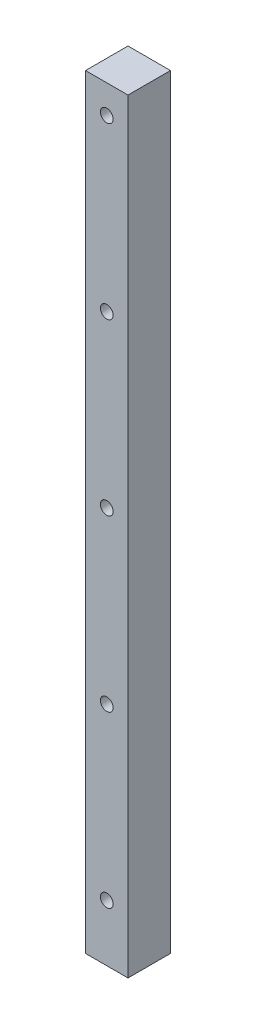
ISO-10303-21;
HEADER;
FILE_DESCRIPTION(('STEP AP214'),'2;1');
FILE_NAME('part.step','',(''),(''),'','','');
FILE_SCHEMA(('AUTOMOTIVE_DESIGN { 1 0 10303 214 1 1 1 1 }'));
ENDSEC;
DATA;
#1=APPLICATION_CONTEXT('core data for automotive mechanical design processes');
#2=APPLICATION_PROTOCOL_DEFINITION('international standard','automotive_design',2000,#1);
#3=PRODUCT_CONTEXT('',#1,'mechanical');
#4=PRODUCT('Part','Part','',(#3));
#5=PRODUCT_RELATED_PRODUCT_CATEGORY('part','',(#4));
#6=PRODUCT_DEFINITION_FORMATION('','',#4);
#7=PRODUCT_DEFINITION_CONTEXT('part definition',#1,'design');
#8=PRODUCT_DEFINITION('design','',#6,#7);
#9=PRODUCT_DEFINITION_SHAPE('','',#8);
#10=(LENGTH_UNIT() NAMED_UNIT(*) SI_UNIT(.MILLI.,.METRE.));
#11=(NAMED_UNIT(*) PLANE_ANGLE_UNIT() SI_UNIT($,.RADIAN.));
#12=(NAMED_UNIT(*) SI_UNIT($,.STERADIAN.) SOLID_ANGLE_UNIT());
#13=UNCERTAINTY_MEASURE_WITH_UNIT(LENGTH_MEASURE(1.E-05),#10,'distance_accuracy_value','');
#14=(GEOMETRIC_REPRESENTATION_CONTEXT(3) GLOBAL_UNCERTAINTY_ASSIGNED_CONTEXT((#13)) GLOBAL_UNIT_ASSIGNED_CONTEXT((#10,
#11,#12)) REPRESENTATION_CONTEXT('',''));
#15=CARTESIAN_POINT('',(0.,0.,0.));
#16=DIRECTION('',(0.,0.,1.));
#17=DIRECTION('',(1.,0.,0.));
#18=AXIS2_PLACEMENT_3D('',#15,#16,#17);
#19=CARTESIAN_POINT('',(-7.5,270.,7.5));
#20=DIRECTION('',(1.,0.,0.));
#21=DIRECTION('',(0.,0.,-1.));
#22=AXIS2_PLACEMENT_3D('',#19,#20,#21);
#23=PLANE('',#22);
#24=DIRECTION('',(0.,0.,1.));
#25=VECTOR('',#24,1.);
#26=CARTESIAN_POINT('',(-7.5,0.,7.5));
#27=LINE('',#26,#25);
#28=CARTESIAN_POINT('',(-7.5,0.,-7.5));
#29=VERTEX_POINT('',#28);
#30=CARTESIAN_POINT('',(-7.5,0.,7.5));
#31=VERTEX_POINT('',#30);
#32=EDGE_CURVE('E104',#29,#31,#27,.T.);
#33=ORIENTED_EDGE('',*,*,#32,.T.);
#34=DIRECTION('',(0.,-1.,0.));
#35=VECTOR('',#34,1.);
#36=CARTESIAN_POINT('',(-7.5,270.,7.5));
#37=LINE('',#36,#35);
#38=CARTESIAN_POINT('',(-7.5,270.,7.5));
#39=VERTEX_POINT('',#38);
#40=EDGE_CURVE('E11',#39,#31,#37,.T.);
#41=ORIENTED_EDGE('',*,*,#40,.F.);
#42=DIRECTION('',(0.,0.,1.));
#43=VECTOR('',#42,1.);
#44=CARTESIAN_POINT('',(-7.5,270.,7.5));
#45=LINE('',#44,#43);
#46=CARTESIAN_POINT('',(-7.5,270.,-7.5));
#47=VERTEX_POINT('',#46);
#48=EDGE_CURVE('E92',#47,#39,#45,.T.);
#49=ORIENTED_EDGE('',*,*,#48,.F.);
#50=DIRECTION('',(0.,-1.,0.));
#51=VECTOR('',#50,1.);
#52=CARTESIAN_POINT('',(-7.5,270.,-7.5));
#53=LINE('',#52,#51);
#54=EDGE_CURVE('E100',#47,#29,#53,.T.);
#55=ORIENTED_EDGE('',*,*,#54,.T.);
#56=EDGE_LOOP('',(#33,#41,#49,#55));
#57=FACE_BOUND('',#56,.T.);
#58=ADVANCED_FACE('F41',(#57),#23,.F.);
#59=CARTESIAN_POINT('',(7.5,270.,7.5));
#60=DIRECTION('',(0.,0.,-1.));
#61=DIRECTION('',(-1.,0.,0.));
#62=AXIS2_PLACEMENT_3D('',#59,#60,#61);
#63=PLANE('',#62);
#64=CARTESIAN_POINT('',(0.,20.,7.49999999999999));
#65=DIRECTION('',(0.,0.,-1.));
#66=DIRECTION('',(-1.,0.,0.));
#67=AXIS2_PLACEMENT_3D('',#64,#65,#66);
#68=CIRCLE('',#67,2.25);
#69=CARTESIAN_POINT('',(-2.25,20.,7.49999999999999));
#70=VERTEX_POINT('',#69);
#71=EDGE_CURVE('E107',#70,#70,#68,.T.);
#72=ORIENTED_EDGE('',*,*,#71,.T.);
#73=EDGE_LOOP('',(#72));
#74=FACE_BOUND('',#73,.T.);
#75=CARTESIAN_POINT('',(0.,80.,7.49999999999999));
#76=DIRECTION('',(0.,0.,-1.));
#77=DIRECTION('',(-1.,0.,0.));
#78=AXIS2_PLACEMENT_3D('',#75,#76,#77);
#79=CIRCLE('',#78,2.25);
#80=CARTESIAN_POINT('',(-2.25,80.,7.49999999999999));
#81=VERTEX_POINT('',#80);
#82=EDGE_CURVE('E120',#81,#81,#79,.T.);
#83=ORIENTED_EDGE('',*,*,#82,.T.);
#84=EDGE_LOOP('',(#83));
#85=FACE_BOUND('',#84,.T.);
#86=CARTESIAN_POINT('',(0.,140.,7.49999999999999));
#87=DIRECTION('',(0.,0.,-1.));
#88=DIRECTION('',(-1.,0.,0.));
#89=AXIS2_PLACEMENT_3D('',#86,#87,#88);
#90=CIRCLE('',#89,2.25);
#91=CARTESIAN_POINT('',(-2.25,140.,7.49999999999999));
#92=VERTEX_POINT('',#91);
#93=EDGE_CURVE('E123',#92,#92,#90,.T.);
#94=ORIENTED_EDGE('',*,*,#93,.T.);
#95=EDGE_LOOP('',(#94));
#96=FACE_BOUND('',#95,.T.);
#97=CARTESIAN_POINT('',(0.,200.,7.49999999999999));
#98=DIRECTION('',(0.,0.,-1.));
#99=DIRECTION('',(-1.,0.,0.));
#100=AXIS2_PLACEMENT_3D('',#97,#98,#99);
#101=CIRCLE('',#100,2.25);
#102=CARTESIAN_POINT('',(-2.25,200.,7.49999999999999));
#103=VERTEX_POINT('',#102);
#104=EDGE_CURVE('E126',#103,#103,#101,.T.);
#105=ORIENTED_EDGE('',*,*,#104,.T.);
#106=EDGE_LOOP('',(#105));
#107=FACE_BOUND('',#106,.T.);
#108=CARTESIAN_POINT('',(0.,260.,7.49999999999999));
#109=DIRECTION('',(0.,0.,-1.));
#110=DIRECTION('',(-1.,0.,0.));
#111=AXIS2_PLACEMENT_3D('',#108,#109,#110);
#112=CIRCLE('',#111,2.25);
#113=CARTESIAN_POINT('',(-2.25,260.,7.49999999999999));
#114=VERTEX_POINT('',#113);
#115=EDGE_CURVE('E129',#114,#114,#112,.T.);
#116=ORIENTED_EDGE('',*,*,#115,.T.);
#117=EDGE_LOOP('',(#116));
#118=FACE_BOUND('',#117,.T.);
#119=DIRECTION('',(1.,0.,0.));
#120=VECTOR('',#119,1.);
#121=CARTESIAN_POINT('',(7.5,0.,7.5));
#122=LINE('',#121,#120);
#123=CARTESIAN_POINT('',(7.5,0.,7.5));
#124=VERTEX_POINT('',#123);
#125=EDGE_CURVE('E96',#31,#124,#122,.T.);
#126=ORIENTED_EDGE('',*,*,#125,.T.);
#127=DIRECTION('',(0.,-1.,0.));
#128=VECTOR('',#127,1.);
#129=CARTESIAN_POINT('',(7.5,270.,7.5));
#130=LINE('',#129,#128);
#131=CARTESIAN_POINT('',(7.5,270.,7.5));
#132=VERTEX_POINT('',#131);
#133=EDGE_CURVE('E49',#132,#124,#130,.T.);
#134=ORIENTED_EDGE('',*,*,#133,.F.);
#135=DIRECTION('',(1.,0.,0.));
#136=VECTOR('',#135,1.);
#137=CARTESIAN_POINT('',(7.5,270.,7.5));
#138=LINE('',#137,#136);
#139=EDGE_CURVE('E87',#39,#132,#138,.T.);
#140=ORIENTED_EDGE('',*,*,#139,.F.);
#141=ORIENTED_EDGE('',*,*,#40,.T.);
#142=EDGE_LOOP('',(#126,#134,#140,#141));
#143=FACE_BOUND('',#142,.T.);
#144=ADVANCED_FACE('F95',(#74,#85,#96,#107,#118,#143),#63,.F.);
#145=CARTESIAN_POINT('',(7.5,270.,7.5));
#146=DIRECTION('',(-1.,0.,0.));
#147=DIRECTION('',(0.,0.,1.));
#148=AXIS2_PLACEMENT_3D('',#145,#146,#147);
#149=PLANE('',#148);
#150=DIRECTION('',(0.,0.,-1.));
#151=VECTOR('',#150,1.);
#152=CARTESIAN_POINT('',(7.5,0.,7.5));
#153=LINE('',#152,#151);
#154=CARTESIAN_POINT('',(7.5,0.,-7.5));
#155=VERTEX_POINT('',#154);
#156=EDGE_CURVE('E74',#124,#155,#153,.T.);
#157=ORIENTED_EDGE('',*,*,#156,.T.);
#158=DIRECTION('',(0.,-1.,0.));
#159=VECTOR('',#158,1.);
#160=CARTESIAN_POINT('',(7.5,270.,-7.5));
#161=LINE('',#160,#159);
#162=CARTESIAN_POINT('',(7.5,270.,-7.5));
#163=VERTEX_POINT('',#162);
#164=EDGE_CURVE('E97',#163,#155,#161,.T.);
#165=ORIENTED_EDGE('',*,*,#164,.F.);
#166=DIRECTION('',(0.,0.,-1.));
#167=VECTOR('',#166,1.);
#168=CARTESIAN_POINT('',(7.5,270.,7.5));
#169=LINE('',#168,#167);
#170=EDGE_CURVE('E90',#132,#163,#169,.T.);
#171=ORIENTED_EDGE('',*,*,#170,.F.);
#172=ORIENTED_EDGE('',*,*,#133,.T.);
#173=EDGE_LOOP('',(#157,#165,#171,#172));
#174=FACE_BOUND('',#173,.T.);
#175=ADVANCED_FACE('F98',(#174),#149,.F.);
#176=CARTESIAN_POINT('',(7.5,270.,-7.5));
#177=DIRECTION('',(0.,0.,1.));
#178=DIRECTION('',(1.,0.,0.));
#179=AXIS2_PLACEMENT_3D('',#176,#177,#178);
#180=PLANE('',#179);
#181=CARTESIAN_POINT('',(0.,20.,-7.5));
#182=DIRECTION('',(0.,0.,-1.));
#183=DIRECTION('',(-1.,0.,0.));
#184=AXIS2_PLACEMENT_3D('',#181,#182,#183);
#185=CIRCLE('',#184,2.25);
#186=CARTESIAN_POINT('',(-2.25,20.,-7.5));
#187=VERTEX_POINT('',#186);
#188=EDGE_CURVE('E132',#187,#187,#185,.T.);
#189=ORIENTED_EDGE('',*,*,#188,.F.);
#190=EDGE_LOOP('',(#189));
#191=FACE_BOUND('',#190,.T.);
#192=CARTESIAN_POINT('',(0.,80.,-7.5));
#193=DIRECTION('',(0.,0.,-1.));
#194=DIRECTION('',(-1.,0.,0.));
#195=AXIS2_PLACEMENT_3D('',#192,#193,#194);
#196=CIRCLE('',#195,2.25);
#197=CARTESIAN_POINT('',(-2.25,80.,-7.5));
#198=VERTEX_POINT('',#197);
#199=EDGE_CURVE('E142',#198,#198,#196,.T.);
#200=ORIENTED_EDGE('',*,*,#199,.F.);
#201=EDGE_LOOP('',(#200));
#202=FACE_BOUND('',#201,.T.);
#203=CARTESIAN_POINT('',(0.,140.,-7.5));
#204=DIRECTION('',(0.,0.,-1.));
#205=DIRECTION('',(-1.,0.,0.));
#206=AXIS2_PLACEMENT_3D('',#203,#204,#205);
#207=CIRCLE('',#206,2.25);
#208=CARTESIAN_POINT('',(-2.25,140.,-7.5));
#209=VERTEX_POINT('',#208);
#210=EDGE_CURVE('E139',#209,#209,#207,.T.);
#211=ORIENTED_EDGE('',*,*,#210,.F.);
#212=EDGE_LOOP('',(#211));
#213=FACE_BOUND('',#212,.T.);
#214=CARTESIAN_POINT('',(0.,200.,-7.5));
#215=DIRECTION('',(0.,0.,-1.));
#216=DIRECTION('',(-1.,0.,0.));
#217=AXIS2_PLACEMENT_3D('',#214,#215,#216);
#218=CIRCLE('',#217,2.25);
#219=CARTESIAN_POINT('',(-2.25,200.,-7.5));
#220=VERTEX_POINT('',#219);
#221=EDGE_CURVE('E136',#220,#220,#218,.T.);
#222=ORIENTED_EDGE('',*,*,#221,.F.);
#223=EDGE_LOOP('',(#222));
#224=FACE_BOUND('',#223,.T.);
#225=CARTESIAN_POINT('',(0.,260.,-7.5));
#226=DIRECTION('',(0.,0.,-1.));
#227=DIRECTION('',(-1.,0.,0.));
#228=AXIS2_PLACEMENT_3D('',#225,#226,#227);
#229=CIRCLE('',#228,2.25);
#230=CARTESIAN_POINT('',(-2.25,260.,-7.5));
#231=VERTEX_POINT('',#230);
#232=EDGE_CURVE('E133',#231,#231,#229,.T.);
#233=ORIENTED_EDGE('',*,*,#232,.F.);
#234=EDGE_LOOP('',(#233));
#235=FACE_BOUND('',#234,.T.);
#236=DIRECTION('',(-1.,0.,0.));
#237=VECTOR('',#236,1.);
#238=CARTESIAN_POINT('',(7.5,0.,-7.5));
#239=LINE('',#238,#237);
#240=EDGE_CURVE('E80',#155,#29,#239,.T.);
#241=ORIENTED_EDGE('',*,*,#240,.T.);
#242=ORIENTED_EDGE('',*,*,#54,.F.);
#243=DIRECTION('',(-1.,0.,0.));
#244=VECTOR('',#243,1.);
#245=CARTESIAN_POINT('',(7.5,270.,-7.5));
#246=LINE('',#245,#244);
#247=EDGE_CURVE('E57',#163,#47,#246,.T.);
#248=ORIENTED_EDGE('',*,*,#247,.F.);
#249=ORIENTED_EDGE('',*,*,#164,.T.);
#250=EDGE_LOOP('',(#241,#242,#248,#249));
#251=FACE_BOUND('',#250,.T.);
#252=ADVANCED_FACE('F112',(#191,#202,#213,#224,#235,#251),#180,.F.);
#253=CARTESIAN_POINT('',(0.,270.,0.));
#254=DIRECTION('',(0.,1.,0.));
#255=DIRECTION('',(0.,0.,1.));
#256=AXIS2_PLACEMENT_3D('',#253,#254,#255);
#257=PLANE('',#256);
#258=ORIENTED_EDGE('',*,*,#48,.T.);
#259=ORIENTED_EDGE('',*,*,#139,.T.);
#260=ORIENTED_EDGE('',*,*,#170,.T.);
#261=ORIENTED_EDGE('',*,*,#247,.T.);
#262=EDGE_LOOP('',(#258,#259,#260,#261));
#263=FACE_BOUND('',#262,.T.);
#264=ADVANCED_FACE('F88',(#263),#257,.T.);
#265=CARTESIAN_POINT('',(0.,0.,0.));
#266=DIRECTION('',(0.,1.,0.));
#267=DIRECTION('',(0.,0.,1.));
#268=AXIS2_PLACEMENT_3D('',#265,#266,#267);
#269=PLANE('',#268);
#270=ORIENTED_EDGE('',*,*,#32,.F.);
#271=ORIENTED_EDGE('',*,*,#240,.F.);
#272=ORIENTED_EDGE('',*,*,#156,.F.);
#273=ORIENTED_EDGE('',*,*,#125,.F.);
#274=EDGE_LOOP('',(#270,#271,#272,#273));
#275=FACE_BOUND('',#274,.T.);
#276=ADVANCED_FACE('F115',(#275),#269,.F.);
#277=CARTESIAN_POINT('',(0.,260.,111.5));
#278=DIRECTION('',(0.,0.,-1.));
#279=DIRECTION('',(-1.,0.,0.));
#280=AXIS2_PLACEMENT_3D('',#277,#278,#279);
#281=CYLINDRICAL_SURFACE('',#280,2.25);
#282=ORIENTED_EDGE('',*,*,#232,.T.);
#283=EDGE_LOOP('',(#282));
#284=FACE_BOUND('',#283,.T.);
#285=ORIENTED_EDGE('',*,*,#115,.F.);
#286=EDGE_LOOP('',(#285));
#287=FACE_BOUND('',#286,.T.);
#288=ADVANCED_FACE('F162',(#284,#287),#281,.F.);
#289=CARTESIAN_POINT('',(0.,200.,111.5));
#290=DIRECTION('',(0.,0.,-1.));
#291=DIRECTION('',(-1.,0.,0.));
#292=AXIS2_PLACEMENT_3D('',#289,#290,#291);
#293=CYLINDRICAL_SURFACE('',#292,2.25);
#294=ORIENTED_EDGE('',*,*,#221,.T.);
#295=EDGE_LOOP('',(#294));
#296=FACE_BOUND('',#295,.T.);
#297=ORIENTED_EDGE('',*,*,#104,.F.);
#298=EDGE_LOOP('',(#297));
#299=FACE_BOUND('',#298,.T.);
#300=ADVANCED_FACE('F165',(#296,#299),#293,.F.);
#301=CARTESIAN_POINT('',(0.,140.,111.5));
#302=DIRECTION('',(0.,0.,-1.));
#303=DIRECTION('',(-1.,0.,0.));
#304=AXIS2_PLACEMENT_3D('',#301,#302,#303);
#305=CYLINDRICAL_SURFACE('',#304,2.25);
#306=ORIENTED_EDGE('',*,*,#210,.T.);
#307=EDGE_LOOP('',(#306));
#308=FACE_BOUND('',#307,.T.);
#309=ORIENTED_EDGE('',*,*,#93,.F.);
#310=EDGE_LOOP('',(#309));
#311=FACE_BOUND('',#310,.T.);
#312=ADVANCED_FACE('F184',(#308,#311),#305,.F.);
#313=CARTESIAN_POINT('',(0.,80.,111.5));
#314=DIRECTION('',(0.,0.,-1.));
#315=DIRECTION('',(-1.,0.,0.));
#316=AXIS2_PLACEMENT_3D('',#313,#314,#315);
#317=CYLINDRICAL_SURFACE('',#316,2.25);
#318=ORIENTED_EDGE('',*,*,#199,.T.);
#319=EDGE_LOOP('',(#318));
#320=FACE_BOUND('',#319,.T.);
#321=ORIENTED_EDGE('',*,*,#82,.F.);
#322=EDGE_LOOP('',(#321));
#323=FACE_BOUND('',#322,.T.);
#324=ADVANCED_FACE('F188',(#320,#323),#317,.F.);
#325=CARTESIAN_POINT('',(0.,20.,111.5));
#326=DIRECTION('',(0.,0.,-1.));
#327=DIRECTION('',(-1.,0.,0.));
#328=AXIS2_PLACEMENT_3D('',#325,#326,#327);
#329=CYLINDRICAL_SURFACE('',#328,2.25);
#330=ORIENTED_EDGE('',*,*,#188,.T.);
#331=EDGE_LOOP('',(#330));
#332=FACE_BOUND('',#331,.T.);
#333=ORIENTED_EDGE('',*,*,#71,.F.);
#334=EDGE_LOOP('',(#333));
#335=FACE_BOUND('',#334,.T.);
#336=ADVANCED_FACE('F148',(#332,#335),#329,.F.);
#337=CLOSED_SHELL('',(#58,#144,#175,#252,#264,#276,#288,#300,#312,#324,#336));
#338=MANIFOLD_SOLID_BREP('B2',#337);
#339=ADVANCED_BREP_SHAPE_REPRESENTATION('',(#18,#338),#14);
#340=SHAPE_DEFINITION_REPRESENTATION(#9,#339);
ENDSEC;
END-ISO-10303-21;
